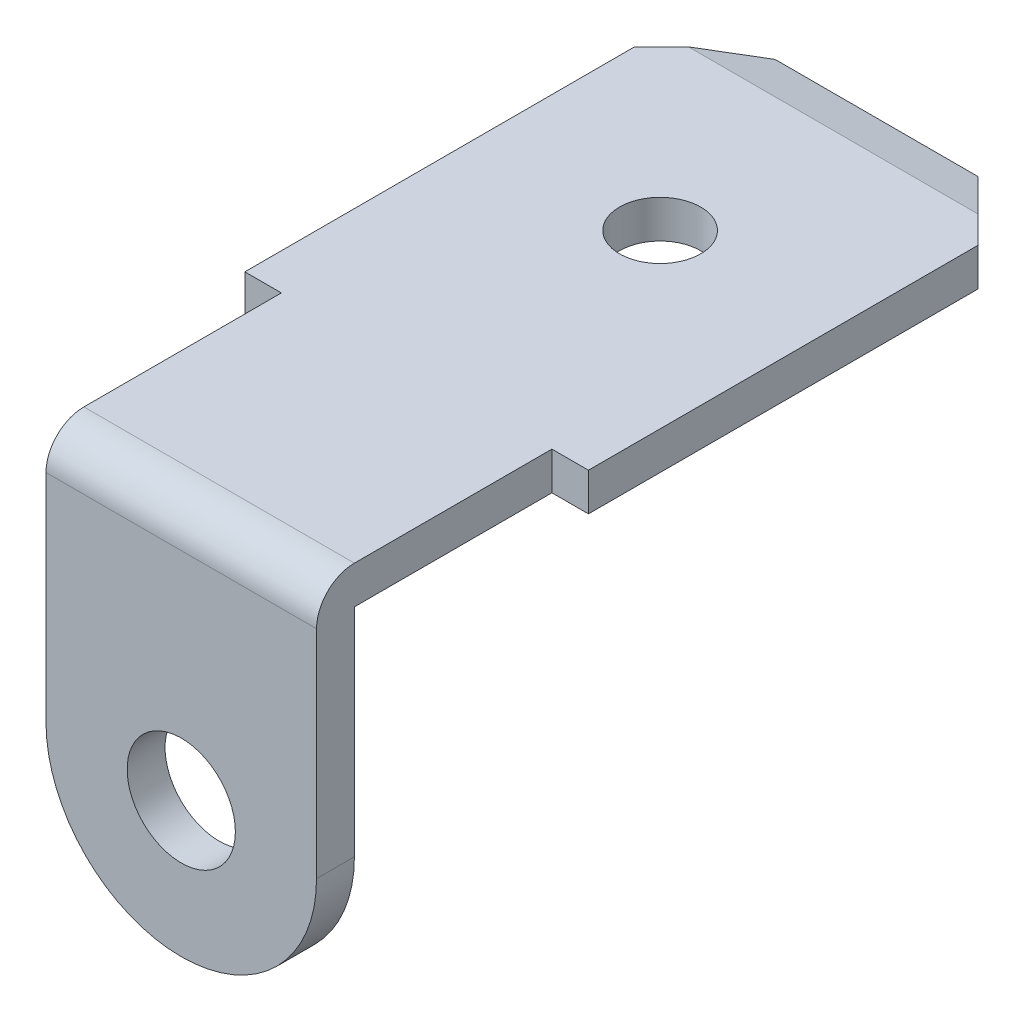
ISO-10303-21;
HEADER;
FILE_DESCRIPTION(('STEP AP214'),'2;1');
FILE_NAME('part.step','',(''),(''),'','','');
FILE_SCHEMA(('AUTOMOTIVE_DESIGN { 1 0 10303 214 1 1 1 1 }'));
ENDSEC;
DATA;
#1=APPLICATION_CONTEXT('core data for automotive mechanical design processes');
#2=APPLICATION_PROTOCOL_DEFINITION('international standard','automotive_design',2000,#1);
#3=PRODUCT_CONTEXT('',#1,'mechanical');
#4=PRODUCT('Part','Part','',(#3));
#5=PRODUCT_RELATED_PRODUCT_CATEGORY('part','',(#4));
#6=PRODUCT_DEFINITION_FORMATION('','',#4);
#7=PRODUCT_DEFINITION_CONTEXT('part definition',#1,'design');
#8=PRODUCT_DEFINITION('design','',#6,#7);
#9=PRODUCT_DEFINITION_SHAPE('','',#8);
#10=(LENGTH_UNIT() NAMED_UNIT(*) SI_UNIT(.MILLI.,.METRE.));
#11=(NAMED_UNIT(*) PLANE_ANGLE_UNIT() SI_UNIT($,.RADIAN.));
#12=(NAMED_UNIT(*) SI_UNIT($,.STERADIAN.) SOLID_ANGLE_UNIT());
#13=UNCERTAINTY_MEASURE_WITH_UNIT(LENGTH_MEASURE(1.E-05),#10,'distance_accuracy_value','');
#14=(GEOMETRIC_REPRESENTATION_CONTEXT(3) GLOBAL_UNCERTAINTY_ASSIGNED_CONTEXT((#13)) GLOBAL_UNIT_ASSIGNED_CONTEXT((#10,
#11,#12)) REPRESENTATION_CONTEXT('',''));
#15=CARTESIAN_POINT('',(0.,0.,0.));
#16=DIRECTION('',(0.,0.,1.));
#17=DIRECTION('',(1.,0.,0.));
#18=AXIS2_PLACEMENT_3D('',#15,#16,#17);
#19=CARTESIAN_POINT('',(0.,0.,0.));
#20=DIRECTION('',(0.,0.,1.));
#21=DIRECTION('',(1.,0.,0.));
#22=AXIS2_PLACEMENT_3D('',#19,#20,#21);
#23=CYLINDRICAL_SURFACE('',#22,1.);
#24=CARTESIAN_POINT('',(0.,0.,0.));
#25=DIRECTION('',(0.,0.,1.));
#26=DIRECTION('',(1.,0.,0.));
#27=AXIS2_PLACEMENT_3D('',#24,#25,#26);
#28=CIRCLE('',#27,1.);
#29=CARTESIAN_POINT('',(1.,0.,0.));
#30=VERTEX_POINT('',#29);
#31=EDGE_CURVE('E315',#30,#30,#28,.T.);
#32=ORIENTED_EDGE('',*,*,#31,.T.);
#33=DIRECTION('',(0.,0.,-1.));
#34=VECTOR('',#33,1.);
#35=CARTESIAN_POINT('',(1.,0.,0.));
#36=LINE('',#35,#34);
#37=CARTESIAN_POINT('',(1.,0.,-0.7));
#38=VERTEX_POINT('',#37);
#39=EDGE_CURVE('E11',#30,#38,#36,.T.);
#40=ORIENTED_EDGE('',*,*,#39,.T.);
#41=CARTESIAN_POINT('',(0.,0.,-0.7));
#42=DIRECTION('',(0.,0.,1.));
#43=DIRECTION('',(1.,0.,0.));
#44=AXIS2_PLACEMENT_3D('',#41,#42,#43);
#45=CIRCLE('',#44,1.);
#46=EDGE_CURVE('E20',#38,#38,#45,.T.);
#47=ORIENTED_EDGE('',*,*,#46,.F.);
#48=ORIENTED_EDGE('',*,*,#39,.F.);
#49=EDGE_LOOP('',(#32,#40,#47,#48));
#50=FACE_BOUND('',#49,.T.);
#51=ADVANCED_FACE('F17',(#50),#23,.F.);
#52=CARTESIAN_POINT('',(0.,1.283011768991,-0.7));
#53=DIRECTION('',(0.,0.,1.));
#54=DIRECTION('',(1.,0.,0.));
#55=AXIS2_PLACEMENT_3D('',#52,#53,#54);
#56=PLANE('',#55);
#57=ORIENTED_EDGE('',*,*,#46,.T.);
#58=EDGE_LOOP('',(#57));
#59=FACE_BOUND('',#58,.T.);
#60=DIRECTION('',(-1.,0.,0.));
#61=VECTOR('',#60,1.);
#62=CARTESIAN_POINT('',(2.5,4.,-0.7));
#63=LINE('',#62,#61);
#64=CARTESIAN_POINT('',(2.5,4.,-0.7));
#65=VERTEX_POINT('',#64);
#66=CARTESIAN_POINT('',(-2.5,4.,-0.7));
#67=VERTEX_POINT('',#66);
#68=EDGE_CURVE('E183',#65,#67,#63,.T.);
#69=ORIENTED_EDGE('',*,*,#68,.F.);
#70=DIRECTION('',(0.,1.,0.));
#71=VECTOR('',#70,1.);
#72=CARTESIAN_POINT('',(2.5,0.,-0.7));
#73=LINE('',#72,#71);
#74=CARTESIAN_POINT('',(2.5,0.,-0.7));
#75=VERTEX_POINT('',#74);
#76=EDGE_CURVE('E297',#75,#65,#73,.T.);
#77=ORIENTED_EDGE('',*,*,#76,.F.);
#78=CARTESIAN_POINT('',(0.,0.,-0.7));
#79=DIRECTION('',(0.,0.,1.));
#80=DIRECTION('',(1.,0.,0.));
#81=AXIS2_PLACEMENT_3D('',#78,#79,#80);
#82=CIRCLE('',#81,2.5);
#83=CARTESIAN_POINT('',(-2.5,0.,-0.7));
#84=VERTEX_POINT('',#83);
#85=EDGE_CURVE('E317',#84,#75,#82,.T.);
#86=ORIENTED_EDGE('',*,*,#85,.F.);
#87=DIRECTION('',(0.,-1.,0.));
#88=VECTOR('',#87,1.);
#89=CARTESIAN_POINT('',(-2.5,4.7,-0.7));
#90=LINE('',#89,#88);
#91=EDGE_CURVE('E217',#67,#84,#90,.T.);
#92=ORIENTED_EDGE('',*,*,#91,.F.);
#93=EDGE_LOOP('',(#69,#77,#86,#92));
#94=FACE_BOUND('',#93,.T.);
#95=ADVANCED_FACE('F377',(#59,#94),#56,.F.);
#96=CARTESIAN_POINT('',(0.,0.,0.));
#97=DIRECTION('',(0.,0.,1.));
#98=DIRECTION('',(1.,0.,0.));
#99=AXIS2_PLACEMENT_3D('',#96,#97,#98);
#100=CYLINDRICAL_SURFACE('',#99,2.5);
#101=DIRECTION('',(0.,0.,-1.));
#102=VECTOR('',#101,1.);
#103=CARTESIAN_POINT('',(-2.5,0.,0.));
#104=LINE('',#103,#102);
#105=CARTESIAN_POINT('',(-2.5,0.,0.));
#106=VERTEX_POINT('',#105);
#107=EDGE_CURVE('E221',#106,#84,#104,.T.);
#108=ORIENTED_EDGE('',*,*,#107,.T.);
#109=ORIENTED_EDGE('',*,*,#85,.T.);
#110=DIRECTION('',(0.,0.,-1.));
#111=VECTOR('',#110,1.);
#112=CARTESIAN_POINT('',(2.5,0.,0.));
#113=LINE('',#112,#111);
#114=CARTESIAN_POINT('',(2.5,0.,0.));
#115=VERTEX_POINT('',#114);
#116=EDGE_CURVE('E293',#115,#75,#113,.T.);
#117=ORIENTED_EDGE('',*,*,#116,.F.);
#118=CARTESIAN_POINT('',(0.,0.,0.));
#119=DIRECTION('',(0.,0.,1.));
#120=DIRECTION('',(1.,0.,0.));
#121=AXIS2_PLACEMENT_3D('',#118,#119,#120);
#122=CIRCLE('',#121,2.5);
#123=EDGE_CURVE('E242',#106,#115,#122,.T.);
#124=ORIENTED_EDGE('',*,*,#123,.F.);
#125=EDGE_LOOP('',(#108,#109,#117,#124));
#126=FACE_BOUND('',#125,.T.);
#127=ADVANCED_FACE('F422',(#126),#100,.T.);
#128=CARTESIAN_POINT('',(0.,1.283011768991,0.));
#129=DIRECTION('',(0.,0.,1.));
#130=DIRECTION('',(1.,0.,0.));
#131=AXIS2_PLACEMENT_3D('',#128,#129,#130);
#132=PLANE('',#131);
#133=ORIENTED_EDGE('',*,*,#31,.F.);
#134=EDGE_LOOP('',(#133));
#135=FACE_BOUND('',#134,.T.);
#136=DIRECTION('',(0.,1.,0.));
#137=VECTOR('',#136,1.);
#138=CARTESIAN_POINT('',(2.5,0.,0.));
#139=LINE('',#138,#137);
#140=CARTESIAN_POINT('',(2.5,4.,0.));
#141=VERTEX_POINT('',#140);
#142=EDGE_CURVE('E292',#115,#141,#139,.T.);
#143=ORIENTED_EDGE('',*,*,#142,.T.);
#144=DIRECTION('',(1.,0.,0.));
#145=VECTOR('',#144,1.);
#146=CARTESIAN_POINT('',(-2.5,4.,0.));
#147=LINE('',#146,#145);
#148=CARTESIAN_POINT('',(-2.5,4.,0.));
#149=VERTEX_POINT('',#148);
#150=EDGE_CURVE('E285',#149,#141,#147,.T.);
#151=ORIENTED_EDGE('',*,*,#150,.F.);
#152=DIRECTION('',(0.,-1.,0.));
#153=VECTOR('',#152,1.);
#154=CARTESIAN_POINT('',(-2.5,4.7,0.));
#155=LINE('',#154,#153);
#156=EDGE_CURVE('E270',#149,#106,#155,.T.);
#157=ORIENTED_EDGE('',*,*,#156,.T.);
#158=ORIENTED_EDGE('',*,*,#123,.T.);
#159=EDGE_LOOP('',(#143,#151,#157,#158));
#160=FACE_BOUND('',#159,.T.);
#161=ADVANCED_FACE('F421',(#135,#160),#132,.T.);
#162=CARTESIAN_POINT('',(0.,4.,-6.852754078708));
#163=DIRECTION('',(0.,1.,0.));
#164=DIRECTION('',(0.,0.,-1.));
#165=AXIS2_PLACEMENT_3D('',#162,#163,#164);
#166=PLANE('',#165);
#167=CARTESIAN_POINT('',(0.,4.,-8.85));
#168=DIRECTION('',(0.,1.,0.));
#169=DIRECTION('',(-1.,0.,0.));
#170=AXIS2_PLACEMENT_3D('',#167,#168,#169);
#171=CIRCLE('',#170,0.75);
#172=CARTESIAN_POINT('',(-0.75,4.,-8.85));
#173=VERTEX_POINT('',#172);
#174=EDGE_CURVE('E309',#173,#173,#171,.T.);
#175=ORIENTED_EDGE('',*,*,#174,.T.);
#176=EDGE_LOOP('',(#175));
#177=FACE_BOUND('',#176,.T.);
#178=DIRECTION('',(1.,0.,0.));
#179=VECTOR('',#178,1.);
#180=CARTESIAN_POINT('',(-1.875,4.,-12.05));
#181=LINE('',#180,#179);
#182=CARTESIAN_POINT('',(-2.675,4.,-12.05));
#183=VERTEX_POINT('',#182);
#184=CARTESIAN_POINT('',(2.675,4.,-12.05));
#185=VERTEX_POINT('',#184);
#186=EDGE_CURVE('E172',#183,#185,#181,.T.);
#187=ORIENTED_EDGE('',*,*,#186,.T.);
#188=DIRECTION('',(-0.707106781186548,0.,-0.707106781186548));
#189=VECTOR('',#188,1.);
#190=CARTESIAN_POINT('',(3.175,4.,-11.55));
#191=LINE('',#190,#189);
#192=CARTESIAN_POINT('',(3.175,4.,-11.55));
#193=VERTEX_POINT('',#192);
#194=EDGE_CURVE('E247',#193,#185,#191,.T.);
#195=ORIENTED_EDGE('',*,*,#194,.F.);
#196=DIRECTION('',(0.,0.,1.));
#197=VECTOR('',#196,1.);
#198=CARTESIAN_POINT('',(3.175,4.,-11.55));
#199=LINE('',#198,#197);
#200=CARTESIAN_POINT('',(3.175,4.,-4.35));
#201=VERTEX_POINT('',#200);
#202=EDGE_CURVE('E261',#193,#201,#199,.T.);
#203=ORIENTED_EDGE('',*,*,#202,.T.);
#204=DIRECTION('',(-1.,0.,0.));
#205=VECTOR('',#204,1.);
#206=CARTESIAN_POINT('',(3.175,4.,-4.35));
#207=LINE('',#206,#205);
#208=CARTESIAN_POINT('',(2.5,4.,-4.35));
#209=VERTEX_POINT('',#208);
#210=EDGE_CURVE('E281',#201,#209,#207,.T.);
#211=ORIENTED_EDGE('',*,*,#210,.T.);
#212=DIRECTION('',(0.,0.,1.));
#213=VECTOR('',#212,1.);
#214=CARTESIAN_POINT('',(2.5,4.,-4.35));
#215=LINE('',#214,#213);
#216=EDGE_CURVE('E301',#209,#65,#215,.T.);
#217=ORIENTED_EDGE('',*,*,#216,.T.);
#218=ORIENTED_EDGE('',*,*,#68,.T.);
#219=DIRECTION('',(0.,0.,-1.));
#220=VECTOR('',#219,1.);
#221=CARTESIAN_POINT('',(-2.5,4.,-0.7));
#222=LINE('',#221,#220);
#223=CARTESIAN_POINT('',(-2.5,4.,-4.35));
#224=VERTEX_POINT('',#223);
#225=EDGE_CURVE('E222',#67,#224,#222,.T.);
#226=ORIENTED_EDGE('',*,*,#225,.T.);
#227=DIRECTION('',(-1.,0.,0.));
#228=VECTOR('',#227,1.);
#229=CARTESIAN_POINT('',(-2.5,4.,-4.35));
#230=LINE('',#229,#228);
#231=CARTESIAN_POINT('',(-3.175,4.,-4.35));
#232=VERTEX_POINT('',#231);
#233=EDGE_CURVE('E250',#224,#232,#230,.T.);
#234=ORIENTED_EDGE('',*,*,#233,.T.);
#235=DIRECTION('',(0.,0.,-1.));
#236=VECTOR('',#235,1.);
#237=CARTESIAN_POINT('',(-3.175,4.,-4.35));
#238=LINE('',#237,#236);
#239=CARTESIAN_POINT('',(-3.175,4.,-11.55));
#240=VERTEX_POINT('',#239);
#241=EDGE_CURVE('E190',#232,#240,#238,.T.);
#242=ORIENTED_EDGE('',*,*,#241,.T.);
#243=DIRECTION('',(0.707106781186548,0.,-0.707106781186548));
#244=VECTOR('',#243,1.);
#245=CARTESIAN_POINT('',(-3.175,4.,-11.55));
#246=LINE('',#245,#244);
#247=EDGE_CURVE('E187',#240,#183,#246,.T.);
#248=ORIENTED_EDGE('',*,*,#247,.T.);
#249=EDGE_LOOP('',(#187,#195,#203,#211,#217,#218,#226,#234,#242,#248));
#250=FACE_BOUND('',#249,.T.);
#251=ADVANCED_FACE('F188',(#177,#250),#166,.F.);
#252=CARTESIAN_POINT('',(-1.875,4.1,-12.45));
#253=DIRECTION('',(0.,-0.970142500145391,-0.242535625036098));
#254=DIRECTION('',(0.,0.242535625036098,-0.970142500145391));
#255=AXIS2_PLACEMENT_3D('',#252,#253,#254);
#256=PLANE('',#255);
#257=DIRECTION('',(1.,0.,0.));
#258=VECTOR('',#257,1.);
#259=CARTESIAN_POINT('',(-1.875,4.2,-12.85));
#260=LINE('',#259,#258);
#261=CARTESIAN_POINT('',(-1.875,4.2,-12.85));
#262=VERTEX_POINT('',#261);
#263=CARTESIAN_POINT('',(1.875,4.2,-12.85));
#264=VERTEX_POINT('',#263);
#265=EDGE_CURVE('E184',#262,#264,#260,.T.);
#266=ORIENTED_EDGE('',*,*,#265,.T.);
#267=DIRECTION('',(-0.696310623822761,0.17407765595594,-0.696310623822761));
#268=VECTOR('',#267,1.);
#269=CARTESIAN_POINT('',(1.668939393939,4.251515151515,-13.05606060606));
#270=LINE('',#269,#268);
#271=EDGE_CURVE('E178',#185,#264,#270,.T.);
#272=ORIENTED_EDGE('',*,*,#271,.F.);
#273=ORIENTED_EDGE('',*,*,#186,.F.);
#274=DIRECTION('',(0.696310623822761,0.17407765595594,-0.696310623822761));
#275=VECTOR('',#274,1.);
#276=CARTESIAN_POINT('',(-2.57803030303,4.024242424242,-12.14696969697));
#277=LINE('',#276,#275);
#278=EDGE_CURVE('E176',#183,#262,#277,.T.);
#279=ORIENTED_EDGE('',*,*,#278,.T.);
#280=EDGE_LOOP('',(#266,#272,#273,#279));
#281=FACE_BOUND('',#280,.T.);
#282=ADVANCED_FACE('F174',(#281),#256,.T.);
#283=CARTESIAN_POINT('',(-1.875,4.7,-12.85));
#284=DIRECTION('',(0.,0.,1.));
#285=DIRECTION('',(0.,-1.,0.));
#286=AXIS2_PLACEMENT_3D('',#283,#284,#285);
#287=PLANE('',#286);
#288=DIRECTION('',(1.,0.,0.));
#289=VECTOR('',#288,1.);
#290=CARTESIAN_POINT('',(-1.875,4.5,-12.85));
#291=LINE('',#290,#289);
#292=CARTESIAN_POINT('',(-1.875,4.5,-12.85));
#293=VERTEX_POINT('',#292);
#294=CARTESIAN_POINT('',(1.875,4.5,-12.85));
#295=VERTEX_POINT('',#294);
#296=EDGE_CURVE('E229',#293,#295,#291,.T.);
#297=ORIENTED_EDGE('',*,*,#296,.T.);
#298=DIRECTION('',(0.,-1.,0.));
#299=VECTOR('',#298,1.);
#300=CARTESIAN_POINT('',(1.875,4.7,-12.85));
#301=LINE('',#300,#299);
#302=EDGE_CURVE('E239',#295,#264,#301,.T.);
#303=ORIENTED_EDGE('',*,*,#302,.T.);
#304=ORIENTED_EDGE('',*,*,#265,.F.);
#305=DIRECTION('',(0.,-1.,0.));
#306=VECTOR('',#305,1.);
#307=CARTESIAN_POINT('',(-1.875,4.7,-12.85));
#308=LINE('',#307,#306);
#309=EDGE_CURVE('E200',#293,#262,#308,.T.);
#310=ORIENTED_EDGE('',*,*,#309,.F.);
#311=EDGE_LOOP('',(#297,#303,#304,#310));
#312=FACE_BOUND('',#311,.T.);
#313=ADVANCED_FACE('F359',(#312),#287,.F.);
#314=CARTESIAN_POINT('',(0.,4.7,-8.85));
#315=DIRECTION('',(0.,1.,0.));
#316=DIRECTION('',(-1.,0.,0.));
#317=AXIS2_PLACEMENT_3D('',#314,#315,#316);
#318=CYLINDRICAL_SURFACE('',#317,0.75);
#319=CARTESIAN_POINT('',(0.,4.7,-8.85));
#320=DIRECTION('',(0.,1.,0.));
#321=DIRECTION('',(-1.,0.,0.));
#322=AXIS2_PLACEMENT_3D('',#319,#320,#321);
#323=CIRCLE('',#322,0.75);
#324=CARTESIAN_POINT('',(-0.75,4.7,-8.85));
#325=VERTEX_POINT('',#324);
#326=EDGE_CURVE('E202',#325,#325,#323,.T.);
#327=ORIENTED_EDGE('',*,*,#326,.T.);
#328=DIRECTION('',(0.,-1.,0.));
#329=VECTOR('',#328,1.);
#330=CARTESIAN_POINT('',(-0.75,4.7,-8.85));
#331=LINE('',#330,#329);
#332=EDGE_CURVE('E305',#325,#173,#331,.T.);
#333=ORIENTED_EDGE('',*,*,#332,.T.);
#334=ORIENTED_EDGE('',*,*,#174,.F.);
#335=ORIENTED_EDGE('',*,*,#332,.F.);
#336=EDGE_LOOP('',(#327,#333,#334,#335));
#337=FACE_BOUND('',#336,.T.);
#338=ADVANCED_FACE('F488',(#337),#318,.F.);
#339=CARTESIAN_POINT('',(2.5,3.156629834254,-1.368370165746));
#340=DIRECTION('',(1.,0.,0.));
#341=DIRECTION('',(0.,1.,0.));
#342=AXIS2_PLACEMENT_3D('',#339,#340,#341);
#343=PLANE('',#342);
#344=DIRECTION('',(0.,0.,1.));
#345=VECTOR('',#344,1.);
#346=CARTESIAN_POINT('',(2.5,4.7,-4.35));
#347=LINE('',#346,#345);
#348=CARTESIAN_POINT('',(2.5,4.7,-4.35));
#349=VERTEX_POINT('',#348);
#350=CARTESIAN_POINT('',(2.5,4.7,-0.7));
#351=VERTEX_POINT('',#350);
#352=EDGE_CURVE('E341',#349,#351,#347,.T.);
#353=ORIENTED_EDGE('',*,*,#352,.T.);
#354=CARTESIAN_POINT('',(2.5,4.,-0.7));
#355=DIRECTION('',(-1.,0.,0.));
#356=DIRECTION('',(0.,0.,1.));
#357=AXIS2_PLACEMENT_3D('',#354,#355,#356);
#358=CIRCLE('',#357,0.7);
#359=EDGE_CURVE('E289',#141,#351,#358,.T.);
#360=ORIENTED_EDGE('',*,*,#359,.F.);
#361=ORIENTED_EDGE('',*,*,#142,.F.);
#362=ORIENTED_EDGE('',*,*,#116,.T.);
#363=ORIENTED_EDGE('',*,*,#76,.T.);
#364=ORIENTED_EDGE('',*,*,#216,.F.);
#365=DIRECTION('',(0.,-1.,0.));
#366=VECTOR('',#365,1.);
#367=CARTESIAN_POINT('',(2.5,4.7,-4.35));
#368=LINE('',#367,#366);
#369=EDGE_CURVE('E277',#349,#209,#368,.T.);
#370=ORIENTED_EDGE('',*,*,#369,.F.);
#371=EDGE_LOOP('',(#353,#360,#361,#362,#363,#364,#370));
#372=FACE_BOUND('',#371,.T.);
#373=ADVANCED_FACE('F372',(#372),#343,.T.);
#374=CARTESIAN_POINT('',(-2.5,4.,-0.7));
#375=DIRECTION('',(1.,0.,0.));
#376=DIRECTION('',(0.,0.,1.));
#377=AXIS2_PLACEMENT_3D('',#374,#375,#376);
#378=CYLINDRICAL_SURFACE('',#377,0.7);
#379=ORIENTED_EDGE('',*,*,#150,.T.);
#380=ORIENTED_EDGE('',*,*,#359,.T.);
#381=DIRECTION('',(1.,0.,0.));
#382=VECTOR('',#381,1.);
#383=CARTESIAN_POINT('',(-2.5,4.7,-0.7));
#384=LINE('',#383,#382);
#385=CARTESIAN_POINT('',(-2.5,4.7,-0.7));
#386=VERTEX_POINT('',#385);
#387=EDGE_CURVE('E335',#386,#351,#384,.T.);
#388=ORIENTED_EDGE('',*,*,#387,.F.);
#389=CARTESIAN_POINT('',(-2.5,4.,-0.7));
#390=DIRECTION('',(-1.,0.,0.));
#391=DIRECTION('',(0.,0.,1.));
#392=AXIS2_PLACEMENT_3D('',#389,#390,#391);
#393=CIRCLE('',#392,0.7);
#394=EDGE_CURVE('E274',#149,#386,#393,.T.);
#395=ORIENTED_EDGE('',*,*,#394,.F.);
#396=EDGE_LOOP('',(#379,#380,#388,#395));
#397=FACE_BOUND('',#396,.T.);
#398=ADVANCED_FACE('F417',(#397),#378,.T.);
#399=CARTESIAN_POINT('',(3.175,4.7,-4.35));
#400=DIRECTION('',(0.,0.,-1.));
#401=DIRECTION('',(0.,-1.,0.));
#402=AXIS2_PLACEMENT_3D('',#399,#400,#401);
#403=PLANE('',#402);
#404=DIRECTION('',(-1.,0.,0.));
#405=VECTOR('',#404,1.);
#406=CARTESIAN_POINT('',(3.175,4.7,-4.35));
#407=LINE('',#406,#405);
#408=CARTESIAN_POINT('',(3.175,4.7,-4.35));
#409=VERTEX_POINT('',#408);
#410=EDGE_CURVE('E351',#409,#349,#407,.T.);
#411=ORIENTED_EDGE('',*,*,#410,.T.);
#412=ORIENTED_EDGE('',*,*,#369,.T.);
#413=ORIENTED_EDGE('',*,*,#210,.F.);
#414=DIRECTION('',(0.,-1.,0.));
#415=VECTOR('',#414,1.);
#416=CARTESIAN_POINT('',(3.175,4.7,-4.35));
#417=LINE('',#416,#415);
#418=EDGE_CURVE('E257',#409,#201,#417,.T.);
#419=ORIENTED_EDGE('',*,*,#418,.F.);
#420=EDGE_LOOP('',(#411,#412,#413,#419));
#421=FACE_BOUND('',#420,.T.);
#422=ADVANCED_FACE('F369',(#421),#403,.F.);
#423=CARTESIAN_POINT('',(-2.5,3.156629834254,-1.368370165746));
#424=DIRECTION('',(-1.,0.,0.));
#425=DIRECTION('',(0.,0.,1.));
#426=AXIS2_PLACEMENT_3D('',#423,#424,#425);
#427=PLANE('',#426);
#428=DIRECTION('',(0.,0.,-1.));
#429=VECTOR('',#428,1.);
#430=CARTESIAN_POINT('',(-2.5,4.7,0.));
#431=LINE('',#430,#429);
#432=CARTESIAN_POINT('',(-2.5,4.7,-4.35));
#433=VERTEX_POINT('',#432);
#434=EDGE_CURVE('E331',#386,#433,#431,.T.);
#435=ORIENTED_EDGE('',*,*,#434,.T.);
#436=DIRECTION('',(0.,-1.,0.));
#437=VECTOR('',#436,1.);
#438=CARTESIAN_POINT('',(-2.5,4.7,-4.35));
#439=LINE('',#438,#437);
#440=EDGE_CURVE('E253',#433,#224,#439,.T.);
#441=ORIENTED_EDGE('',*,*,#440,.T.);
#442=ORIENTED_EDGE('',*,*,#225,.F.);
#443=ORIENTED_EDGE('',*,*,#91,.T.);
#444=ORIENTED_EDGE('',*,*,#107,.F.);
#445=ORIENTED_EDGE('',*,*,#156,.F.);
#446=ORIENTED_EDGE('',*,*,#394,.T.);
#447=EDGE_LOOP('',(#435,#441,#442,#443,#444,#445,#446));
#448=FACE_BOUND('',#447,.T.);
#449=ADVANCED_FACE('F380',(#448),#427,.T.);
#450=CARTESIAN_POINT('',(3.175,4.7,-11.55));
#451=DIRECTION('',(-1.,0.,0.));
#452=DIRECTION('',(0.,0.,1.));
#453=AXIS2_PLACEMENT_3D('',#450,#451,#452);
#454=PLANE('',#453);
#455=DIRECTION('',(0.,0.,1.));
#456=VECTOR('',#455,1.);
#457=CARTESIAN_POINT('',(3.175,4.7,-11.55));
#458=LINE('',#457,#456);
#459=CARTESIAN_POINT('',(3.175,4.7,-11.55));
#460=VERTEX_POINT('',#459);
#461=EDGE_CURVE('E354',#460,#409,#458,.T.);
#462=ORIENTED_EDGE('',*,*,#461,.T.);
#463=ORIENTED_EDGE('',*,*,#418,.T.);
#464=ORIENTED_EDGE('',*,*,#202,.F.);
#465=DIRECTION('',(0.,-1.,0.));
#466=VECTOR('',#465,1.);
#467=CARTESIAN_POINT('',(3.175,4.7,-11.55));
#468=LINE('',#467,#466);
#469=EDGE_CURVE('E243',#460,#193,#468,.T.);
#470=ORIENTED_EDGE('',*,*,#469,.F.);
#471=EDGE_LOOP('',(#462,#463,#464,#470));
#472=FACE_BOUND('',#471,.T.);
#473=ADVANCED_FACE('F365',(#472),#454,.F.);
#474=CARTESIAN_POINT('',(-2.5,4.7,-4.35));
#475=DIRECTION('',(0.,0.,-1.));
#476=DIRECTION('',(0.,-1.,0.));
#477=AXIS2_PLACEMENT_3D('',#474,#475,#476);
#478=PLANE('',#477);
#479=DIRECTION('',(-1.,0.,0.));
#480=VECTOR('',#479,1.);
#481=CARTESIAN_POINT('',(-2.5,4.7,-4.35));
#482=LINE('',#481,#480);
#483=CARTESIAN_POINT('',(-3.175,4.7,-4.35));
#484=VERTEX_POINT('',#483);
#485=EDGE_CURVE('E336',#433,#484,#482,.T.);
#486=ORIENTED_EDGE('',*,*,#485,.T.);
#487=DIRECTION('',(0.,-1.,0.));
#488=VECTOR('',#487,1.);
#489=CARTESIAN_POINT('',(-3.175,4.7,-4.35));
#490=LINE('',#489,#488);
#491=EDGE_CURVE('E235',#484,#232,#490,.T.);
#492=ORIENTED_EDGE('',*,*,#491,.T.);
#493=ORIENTED_EDGE('',*,*,#233,.F.);
#494=ORIENTED_EDGE('',*,*,#440,.F.);
#495=EDGE_LOOP('',(#486,#492,#493,#494));
#496=FACE_BOUND('',#495,.T.);
#497=ADVANCED_FACE('F386',(#496),#478,.F.);
#498=CARTESIAN_POINT('',(3.175,4.7,-11.55));
#499=DIRECTION('',(0.707106781186548,0.,-0.707106781186548));
#500=DIRECTION('',(0.,-1.,0.));
#501=AXIS2_PLACEMENT_3D('',#498,#499,#500);
#502=PLANE('',#501);
#503=ORIENTED_EDGE('',*,*,#302,.F.);
#504=DIRECTION('',(-0.696310623822761,-0.17407765595594,-0.696310623822761));
#505=VECTOR('',#504,1.);
#506=CARTESIAN_POINT('',(1.711363636364,4.459090909091,-13.01363636363));
#507=LINE('',#506,#505);
#508=CARTESIAN_POINT('',(2.675,4.7,-12.05));
#509=VERTEX_POINT('',#508);
#510=EDGE_CURVE('E225',#509,#295,#507,.T.);
#511=ORIENTED_EDGE('',*,*,#510,.F.);
#512=DIRECTION('',(-0.707106781186548,0.,-0.707106781186548));
#513=VECTOR('',#512,1.);
#514=CARTESIAN_POINT('',(3.175,4.7,-11.55));
#515=LINE('',#514,#513);
#516=EDGE_CURVE('E213',#460,#509,#515,.T.);
#517=ORIENTED_EDGE('',*,*,#516,.F.);
#518=ORIENTED_EDGE('',*,*,#469,.T.);
#519=ORIENTED_EDGE('',*,*,#194,.T.);
#520=ORIENTED_EDGE('',*,*,#271,.T.);
#521=EDGE_LOOP('',(#503,#511,#517,#518,#519,#520));
#522=FACE_BOUND('',#521,.T.);
#523=ADVANCED_FACE('F361',(#522),#502,.T.);
#524=CARTESIAN_POINT('',(-3.175,4.7,-4.35));
#525=DIRECTION('',(1.,0.,0.));
#526=DIRECTION('',(0.,1.,0.));
#527=AXIS2_PLACEMENT_3D('',#524,#525,#526);
#528=PLANE('',#527);
#529=DIRECTION('',(0.,0.,-1.));
#530=VECTOR('',#529,1.);
#531=CARTESIAN_POINT('',(-3.175,4.7,-4.35));
#532=LINE('',#531,#530);
#533=CARTESIAN_POINT('',(-3.175,4.7,-11.55));
#534=VERTEX_POINT('',#533);
#535=EDGE_CURVE('E391',#484,#534,#532,.T.);
#536=ORIENTED_EDGE('',*,*,#535,.T.);
#537=DIRECTION('',(0.,-1.,0.));
#538=VECTOR('',#537,1.);
#539=CARTESIAN_POINT('',(-3.175,4.7,-11.55));
#540=LINE('',#539,#538);
#541=EDGE_CURVE('E194',#534,#240,#540,.T.);
#542=ORIENTED_EDGE('',*,*,#541,.T.);
#543=ORIENTED_EDGE('',*,*,#241,.F.);
#544=ORIENTED_EDGE('',*,*,#491,.F.);
#545=EDGE_LOOP('',(#536,#542,#543,#544));
#546=FACE_BOUND('',#545,.T.);
#547=ADVANCED_FACE('F390',(#546),#528,.F.);
#548=CARTESIAN_POINT('',(-1.875,4.6,-12.45));
#549=DIRECTION('',(0.,-0.970142500145391,0.242535625036098));
#550=DIRECTION('',(-1.,0.,0.));
#551=AXIS2_PLACEMENT_3D('',#548,#549,#550);
#552=PLANE('',#551);
#553=DIRECTION('',(0.696310623822761,-0.17407765595594,-0.696310623822761));
#554=VECTOR('',#553,1.);
#555=CARTESIAN_POINT('',(-2.620454545455,4.686363636364,-12.10454545454));
#556=LINE('',#555,#554);
#557=CARTESIAN_POINT('',(-2.675,4.7,-12.05));
#558=VERTEX_POINT('',#557);
#559=EDGE_CURVE('E216',#558,#293,#556,.T.);
#560=ORIENTED_EDGE('',*,*,#559,.F.);
#561=DIRECTION('',(1.,0.,0.));
#562=VECTOR('',#561,1.);
#563=CARTESIAN_POINT('',(-1.875,4.7,-12.05));
#564=LINE('',#563,#562);
#565=EDGE_CURVE('E209',#558,#509,#564,.T.);
#566=ORIENTED_EDGE('',*,*,#565,.T.);
#567=ORIENTED_EDGE('',*,*,#510,.T.);
#568=ORIENTED_EDGE('',*,*,#296,.F.);
#569=EDGE_LOOP('',(#560,#566,#567,#568));
#570=FACE_BOUND('',#569,.T.);
#571=ADVANCED_FACE('F556',(#570),#552,.F.);
#572=CARTESIAN_POINT('',(-3.175,4.7,-11.55));
#573=DIRECTION('',(0.707106781186548,0.,0.707106781186548));
#574=DIRECTION('',(0.,-1.,0.));
#575=AXIS2_PLACEMENT_3D('',#572,#573,#574);
#576=PLANE('',#575);
#577=ORIENTED_EDGE('',*,*,#278,.F.);
#578=ORIENTED_EDGE('',*,*,#247,.F.);
#579=ORIENTED_EDGE('',*,*,#541,.F.);
#580=DIRECTION('',(0.707106781186548,0.,-0.707106781186548));
#581=VECTOR('',#580,1.);
#582=CARTESIAN_POINT('',(-3.175,4.7,-11.55));
#583=LINE('',#582,#581);
#584=EDGE_CURVE('E394',#534,#558,#583,.T.);
#585=ORIENTED_EDGE('',*,*,#584,.T.);
#586=ORIENTED_EDGE('',*,*,#559,.T.);
#587=ORIENTED_EDGE('',*,*,#309,.T.);
#588=EDGE_LOOP('',(#577,#578,#579,#585,#586,#587));
#589=FACE_BOUND('',#588,.T.);
#590=ADVANCED_FACE('F197',(#589),#576,.F.);
#591=CARTESIAN_POINT('',(0.,4.7,-6.299906067267));
#592=DIRECTION('',(0.,1.,0.));
#593=DIRECTION('',(0.,0.,-1.));
#594=AXIS2_PLACEMENT_3D('',#591,#592,#593);
#595=PLANE('',#594);
#596=ORIENTED_EDGE('',*,*,#326,.F.);
#597=EDGE_LOOP('',(#596));
#598=FACE_BOUND('',#597,.T.);
#599=ORIENTED_EDGE('',*,*,#584,.F.);
#600=ORIENTED_EDGE('',*,*,#535,.F.);
#601=ORIENTED_EDGE('',*,*,#485,.F.);
#602=ORIENTED_EDGE('',*,*,#434,.F.);
#603=ORIENTED_EDGE('',*,*,#387,.T.);
#604=ORIENTED_EDGE('',*,*,#352,.F.);
#605=ORIENTED_EDGE('',*,*,#410,.F.);
#606=ORIENTED_EDGE('',*,*,#461,.F.);
#607=ORIENTED_EDGE('',*,*,#516,.T.);
#608=ORIENTED_EDGE('',*,*,#565,.F.);
#609=EDGE_LOOP('',(#599,#600,#601,#602,#603,#604,#605,#606,#607,#608));
#610=FACE_BOUND('',#609,.T.);
#611=ADVANCED_FACE('F413',(#598,#610),#595,.T.);
#612=CLOSED_SHELL('',(#51,#95,#127,#161,#251,#282,#313,#338,#373,#398,#422,#449,#473,#497,#523,
#547,#571,#590,#611));
#613=MANIFOLD_SOLID_BREP('B1',#612);
#614=ADVANCED_BREP_SHAPE_REPRESENTATION('',(#18,#613),#14);
#615=SHAPE_DEFINITION_REPRESENTATION(#9,#614);
ENDSEC;
END-ISO-10303-21;
